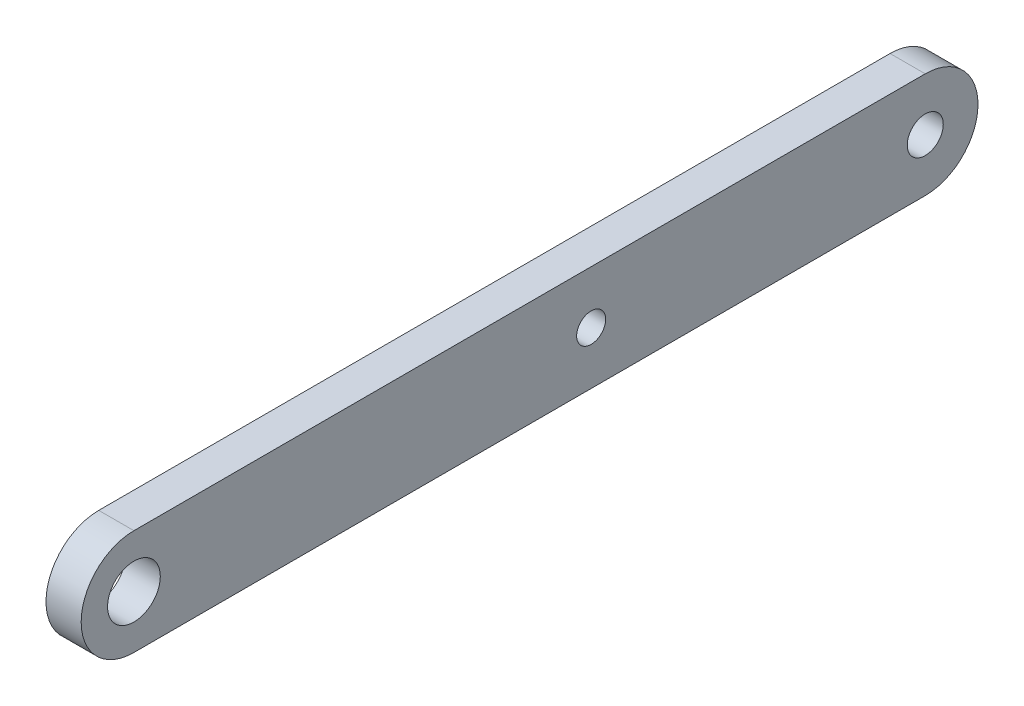
ISO-10303-21;
HEADER;
FILE_DESCRIPTION(('STEP AP214'),'2;1');
FILE_NAME('part.step','',(''),(''),'','','');
FILE_SCHEMA(('AUTOMOTIVE_DESIGN { 1 0 10303 214 1 1 1 1 }'));
ENDSEC;
DATA;
#1=APPLICATION_CONTEXT('core data for automotive mechanical design processes');
#2=APPLICATION_PROTOCOL_DEFINITION('international standard','automotive_design',2000,#1);
#3=PRODUCT_CONTEXT('',#1,'mechanical');
#4=PRODUCT('Part','Part','',(#3));
#5=PRODUCT_RELATED_PRODUCT_CATEGORY('part','',(#4));
#6=PRODUCT_DEFINITION_FORMATION('','',#4);
#7=PRODUCT_DEFINITION_CONTEXT('part definition',#1,'design');
#8=PRODUCT_DEFINITION('design','',#6,#7);
#9=PRODUCT_DEFINITION_SHAPE('','',#8);
#10=(LENGTH_UNIT() NAMED_UNIT(*) SI_UNIT(.MILLI.,.METRE.));
#11=(NAMED_UNIT(*) PLANE_ANGLE_UNIT() SI_UNIT($,.RADIAN.));
#12=(NAMED_UNIT(*) SI_UNIT($,.STERADIAN.) SOLID_ANGLE_UNIT());
#13=UNCERTAINTY_MEASURE_WITH_UNIT(LENGTH_MEASURE(1.E-05),#10,'distance_accuracy_value','');
#14=(GEOMETRIC_REPRESENTATION_CONTEXT(3) GLOBAL_UNCERTAINTY_ASSIGNED_CONTEXT((#13)) GLOBAL_UNIT_ASSIGNED_CONTEXT((#10,
#11,#12)) REPRESENTATION_CONTEXT('',''));
#15=CARTESIAN_POINT('',(0.,0.,0.));
#16=DIRECTION('',(0.,0.,1.));
#17=DIRECTION('',(1.,0.,0.));
#18=AXIS2_PLACEMENT_3D('',#15,#16,#17);
#19=CARTESIAN_POINT('',(4.,0.,0.));
#20=DIRECTION('',(1.,0.,0.));
#21=DIRECTION('',(0.,0.,-1.));
#22=AXIS2_PLACEMENT_3D('',#19,#20,#21);
#23=PLANE('',#22);
#24=CARTESIAN_POINT('',(4.,0.,-52.));
#25=DIRECTION('',(1.,0.,0.));
#26=DIRECTION('',(0.,0.,-1.));
#27=AXIS2_PLACEMENT_3D('',#24,#25,#26);
#28=CIRCLE('',#27,1.65);
#29=CARTESIAN_POINT('',(4.,0.,-53.65));
#30=VERTEX_POINT('',#29);
#31=EDGE_CURVE('E146',#30,#30,#28,.T.);
#32=ORIENTED_EDGE('',*,*,#31,.F.);
#33=EDGE_LOOP('',(#32));
#34=FACE_BOUND('',#33,.T.);
#35=CARTESIAN_POINT('',(4.,0.,0.));
#36=DIRECTION('',(1.,0.,0.));
#37=DIRECTION('',(0.,0.,-1.));
#38=AXIS2_PLACEMENT_3D('',#35,#36,#37);
#39=CIRCLE('',#38,3.);
#40=CARTESIAN_POINT('',(4.,0.,-3.));
#41=VERTEX_POINT('',#40);
#42=EDGE_CURVE('E112',#41,#41,#39,.T.);
#43=ORIENTED_EDGE('',*,*,#42,.F.);
#44=EDGE_LOOP('',(#43));
#45=FACE_BOUND('',#44,.T.);
#46=CARTESIAN_POINT('',(4.,0.,0.));
#47=DIRECTION('',(1.,0.,0.));
#48=DIRECTION('',(0.,0.,-1.));
#49=AXIS2_PLACEMENT_3D('',#46,#47,#48);
#50=CIRCLE('',#49,6.);
#51=CARTESIAN_POINT('',(4.,6.,0.));
#52=VERTEX_POINT('',#51);
#53=CARTESIAN_POINT('',(4.,-6.,0.));
#54=VERTEX_POINT('',#53);
#55=EDGE_CURVE('E92',#52,#54,#50,.T.);
#56=ORIENTED_EDGE('',*,*,#55,.T.);
#57=DIRECTION('',(0.,0.,-1.));
#58=VECTOR('',#57,1.);
#59=CARTESIAN_POINT('',(4.,-6.,0.));
#60=LINE('',#59,#58);
#61=CARTESIAN_POINT('',(4.,-6.,-90.));
#62=VERTEX_POINT('',#61);
#63=EDGE_CURVE('E87',#54,#62,#60,.T.);
#64=ORIENTED_EDGE('',*,*,#63,.T.);
#65=CARTESIAN_POINT('',(4.,0.,-90.));
#66=DIRECTION('',(1.,0.,0.));
#67=DIRECTION('',(0.,0.,-1.));
#68=AXIS2_PLACEMENT_3D('',#65,#66,#67);
#69=CIRCLE('',#68,6.);
#70=CARTESIAN_POINT('',(4.,6.,-90.));
#71=VERTEX_POINT('',#70);
#72=EDGE_CURVE('E90',#62,#71,#69,.T.);
#73=ORIENTED_EDGE('',*,*,#72,.T.);
#74=DIRECTION('',(0.,0.,1.));
#75=VECTOR('',#74,1.);
#76=CARTESIAN_POINT('',(4.,6.,0.));
#77=LINE('',#76,#75);
#78=EDGE_CURVE('E57',#71,#52,#77,.T.);
#79=ORIENTED_EDGE('',*,*,#78,.T.);
#80=EDGE_LOOP('',(#56,#64,#73,#79));
#81=FACE_BOUND('',#80,.T.);
#82=CARTESIAN_POINT('',(4.,0.,-90.));
#83=DIRECTION('',(1.,0.,0.));
#84=DIRECTION('',(0.,0.,-1.));
#85=AXIS2_PLACEMENT_3D('',#82,#83,#84);
#86=CIRCLE('',#85,2.04999999999999);
#87=CARTESIAN_POINT('',(4.,0.,-92.05));
#88=VERTEX_POINT('',#87);
#89=EDGE_CURVE('E134',#88,#88,#86,.T.);
#90=ORIENTED_EDGE('',*,*,#89,.F.);
#91=EDGE_LOOP('',(#90));
#92=FACE_BOUND('',#91,.T.);
#93=ADVANCED_FACE('F39',(#34,#45,#81,#92),#23,.T.);
#94=CARTESIAN_POINT('',(0.,0.,0.));
#95=DIRECTION('',(1.,0.,0.));
#96=DIRECTION('',(0.,0.,-1.));
#97=AXIS2_PLACEMENT_3D('',#94,#95,#96);
#98=PLANE('',#97);
#99=CARTESIAN_POINT('',(0.,0.,-52.));
#100=DIRECTION('',(1.,0.,0.));
#101=DIRECTION('',(0.,0.,-1.));
#102=AXIS2_PLACEMENT_3D('',#99,#100,#101);
#103=CIRCLE('',#102,1.65);
#104=CARTESIAN_POINT('',(0.,0.,-53.65));
#105=VERTEX_POINT('',#104);
#106=EDGE_CURVE('E142',#105,#105,#103,.T.);
#107=ORIENTED_EDGE('',*,*,#106,.T.);
#108=EDGE_LOOP('',(#107));
#109=FACE_BOUND('',#108,.T.);
#110=CARTESIAN_POINT('',(0.,0.,0.));
#111=DIRECTION('',(1.,0.,0.));
#112=DIRECTION('',(0.,0.,-1.));
#113=AXIS2_PLACEMENT_3D('',#110,#111,#112);
#114=CIRCLE('',#113,6.);
#115=CARTESIAN_POINT('',(0.,6.,0.));
#116=VERTEX_POINT('',#115);
#117=CARTESIAN_POINT('',(0.,-6.,0.));
#118=VERTEX_POINT('',#117);
#119=EDGE_CURVE('E108',#116,#118,#114,.T.);
#120=ORIENTED_EDGE('',*,*,#119,.F.);
#121=DIRECTION('',(0.,0.,1.));
#122=VECTOR('',#121,1.);
#123=CARTESIAN_POINT('',(0.,6.,0.));
#124=LINE('',#123,#122);
#125=CARTESIAN_POINT('',(0.,6.,-90.));
#126=VERTEX_POINT('',#125);
#127=EDGE_CURVE('E80',#126,#116,#124,.T.);
#128=ORIENTED_EDGE('',*,*,#127,.F.);
#129=CARTESIAN_POINT('',(0.,0.,-90.));
#130=DIRECTION('',(1.,0.,0.));
#131=DIRECTION('',(0.,0.,-1.));
#132=AXIS2_PLACEMENT_3D('',#129,#130,#131);
#133=CIRCLE('',#132,6.);
#134=CARTESIAN_POINT('',(0.,-6.,-90.));
#135=VERTEX_POINT('',#134);
#136=EDGE_CURVE('E74',#135,#126,#133,.T.);
#137=ORIENTED_EDGE('',*,*,#136,.F.);
#138=DIRECTION('',(0.,0.,-1.));
#139=VECTOR('',#138,1.);
#140=CARTESIAN_POINT('',(0.,-6.,0.));
#141=LINE('',#140,#139);
#142=EDGE_CURVE('E97',#118,#135,#141,.T.);
#143=ORIENTED_EDGE('',*,*,#142,.F.);
#144=EDGE_LOOP('',(#120,#128,#137,#143));
#145=FACE_BOUND('',#144,.T.);
#146=CARTESIAN_POINT('',(0.,0.,0.));
#147=DIRECTION('',(1.,0.,0.));
#148=DIRECTION('',(0.,0.,-1.));
#149=AXIS2_PLACEMENT_3D('',#146,#147,#148);
#150=CIRCLE('',#149,3.);
#151=CARTESIAN_POINT('',(0.,0.,-3.));
#152=VERTEX_POINT('',#151);
#153=EDGE_CURVE('E130',#152,#152,#150,.T.);
#154=ORIENTED_EDGE('',*,*,#153,.T.);
#155=EDGE_LOOP('',(#154));
#156=FACE_BOUND('',#155,.T.);
#157=CARTESIAN_POINT('',(0.,0.,-90.));
#158=DIRECTION('',(1.,0.,0.));
#159=DIRECTION('',(0.,0.,-1.));
#160=AXIS2_PLACEMENT_3D('',#157,#158,#159);
#161=CIRCLE('',#160,2.04999999999999);
#162=CARTESIAN_POINT('',(0.,0.,-92.05));
#163=VERTEX_POINT('',#162);
#164=EDGE_CURVE('E138',#163,#163,#161,.T.);
#165=ORIENTED_EDGE('',*,*,#164,.T.);
#166=EDGE_LOOP('',(#165));
#167=FACE_BOUND('',#166,.T.);
#168=ADVANCED_FACE('F125',(#109,#145,#156,#167),#98,.F.);
#169=CARTESIAN_POINT('',(4.,0.,0.));
#170=DIRECTION('',(-1.,0.,0.));
#171=DIRECTION('',(0.,0.,1.));
#172=AXIS2_PLACEMENT_3D('',#169,#170,#171);
#173=CYLINDRICAL_SURFACE('',#172,6.);
#174=ORIENTED_EDGE('',*,*,#119,.T.);
#175=DIRECTION('',(-1.,0.,0.));
#176=VECTOR('',#175,1.);
#177=CARTESIAN_POINT('',(4.,-6.,0.));
#178=LINE('',#177,#176);
#179=EDGE_CURVE('E11',#54,#118,#178,.T.);
#180=ORIENTED_EDGE('',*,*,#179,.F.);
#181=ORIENTED_EDGE('',*,*,#55,.F.);
#182=DIRECTION('',(-1.,0.,0.));
#183=VECTOR('',#182,1.);
#184=CARTESIAN_POINT('',(4.,6.,0.));
#185=LINE('',#184,#183);
#186=EDGE_CURVE('E104',#52,#116,#185,.T.);
#187=ORIENTED_EDGE('',*,*,#186,.T.);
#188=EDGE_LOOP('',(#174,#180,#181,#187));
#189=FACE_BOUND('',#188,.T.);
#190=ADVANCED_FACE('F41',(#189),#173,.T.);
#191=CARTESIAN_POINT('',(4.,-6.,0.));
#192=DIRECTION('',(0.,1.,0.));
#193=DIRECTION('',(0.,0.,1.));
#194=AXIS2_PLACEMENT_3D('',#191,#192,#193);
#195=PLANE('',#194);
#196=ORIENTED_EDGE('',*,*,#142,.T.);
#197=DIRECTION('',(-1.,0.,0.));
#198=VECTOR('',#197,1.);
#199=CARTESIAN_POINT('',(4.,-6.,-90.));
#200=LINE('',#199,#198);
#201=EDGE_CURVE('E49',#62,#135,#200,.T.);
#202=ORIENTED_EDGE('',*,*,#201,.F.);
#203=ORIENTED_EDGE('',*,*,#63,.F.);
#204=ORIENTED_EDGE('',*,*,#179,.T.);
#205=EDGE_LOOP('',(#196,#202,#203,#204));
#206=FACE_BOUND('',#205,.T.);
#207=ADVANCED_FACE('F96',(#206),#195,.F.);
#208=CARTESIAN_POINT('',(4.,0.,-90.));
#209=DIRECTION('',(-1.,0.,0.));
#210=DIRECTION('',(0.,0.,1.));
#211=AXIS2_PLACEMENT_3D('',#208,#209,#210);
#212=CYLINDRICAL_SURFACE('',#211,6.);
#213=ORIENTED_EDGE('',*,*,#136,.T.);
#214=DIRECTION('',(-1.,0.,0.));
#215=VECTOR('',#214,1.);
#216=CARTESIAN_POINT('',(4.,6.,-90.));
#217=LINE('',#216,#215);
#218=EDGE_CURVE('E99',#71,#126,#217,.T.);
#219=ORIENTED_EDGE('',*,*,#218,.F.);
#220=ORIENTED_EDGE('',*,*,#72,.F.);
#221=ORIENTED_EDGE('',*,*,#201,.T.);
#222=EDGE_LOOP('',(#213,#219,#220,#221));
#223=FACE_BOUND('',#222,.T.);
#224=ADVANCED_FACE('F100',(#223),#212,.T.);
#225=CARTESIAN_POINT('',(4.,6.,0.));
#226=DIRECTION('',(0.,-1.,0.));
#227=DIRECTION('',(0.,0.,-1.));
#228=AXIS2_PLACEMENT_3D('',#225,#226,#227);
#229=PLANE('',#228);
#230=ORIENTED_EDGE('',*,*,#127,.T.);
#231=ORIENTED_EDGE('',*,*,#186,.F.);
#232=ORIENTED_EDGE('',*,*,#78,.F.);
#233=ORIENTED_EDGE('',*,*,#218,.T.);
#234=EDGE_LOOP('',(#230,#231,#232,#233));
#235=FACE_BOUND('',#234,.T.);
#236=ADVANCED_FACE('F122',(#235),#229,.F.);
#237=CARTESIAN_POINT('',(4.,0.,0.));
#238=DIRECTION('',(-1.,0.,0.));
#239=DIRECTION('',(0.,0.,1.));
#240=AXIS2_PLACEMENT_3D('',#237,#238,#239);
#241=CYLINDRICAL_SURFACE('',#240,3.);
#242=ORIENTED_EDGE('',*,*,#42,.T.);
#243=EDGE_LOOP('',(#242));
#244=FACE_BOUND('',#243,.T.);
#245=ORIENTED_EDGE('',*,*,#153,.F.);
#246=EDGE_LOOP('',(#245));
#247=FACE_BOUND('',#246,.T.);
#248=ADVANCED_FACE('F167',(#244,#247),#241,.F.);
#249=CARTESIAN_POINT('',(4.,0.,-90.));
#250=DIRECTION('',(-1.,0.,0.));
#251=DIRECTION('',(0.,0.,1.));
#252=AXIS2_PLACEMENT_3D('',#249,#250,#251);
#253=CYLINDRICAL_SURFACE('',#252,2.04999999999999);
#254=ORIENTED_EDGE('',*,*,#89,.T.);
#255=EDGE_LOOP('',(#254));
#256=FACE_BOUND('',#255,.T.);
#257=ORIENTED_EDGE('',*,*,#164,.F.);
#258=EDGE_LOOP('',(#257));
#259=FACE_BOUND('',#258,.T.);
#260=ADVANCED_FACE('F158',(#256,#259),#253,.F.);
#261=CARTESIAN_POINT('',(0.,0.,-52.));
#262=DIRECTION('',(1.,0.,0.));
#263=DIRECTION('',(0.,0.,-1.));
#264=AXIS2_PLACEMENT_3D('',#261,#262,#263);
#265=CYLINDRICAL_SURFACE('',#264,1.65);
#266=ORIENTED_EDGE('',*,*,#106,.F.);
#267=EDGE_LOOP('',(#266));
#268=FACE_BOUND('',#267,.T.);
#269=ORIENTED_EDGE('',*,*,#31,.T.);
#270=EDGE_LOOP('',(#269));
#271=FACE_BOUND('',#270,.T.);
#272=ADVANCED_FACE('F155',(#268,#271),#265,.F.);
#273=CLOSED_SHELL('',(#93,#168,#190,#207,#224,#236,#248,#260,#272));
#274=MANIFOLD_SOLID_BREP('B2',#273);
#275=ADVANCED_BREP_SHAPE_REPRESENTATION('',(#18,#274),#14);
#276=SHAPE_DEFINITION_REPRESENTATION(#9,#275);
ENDSEC;
END-ISO-10303-21;
